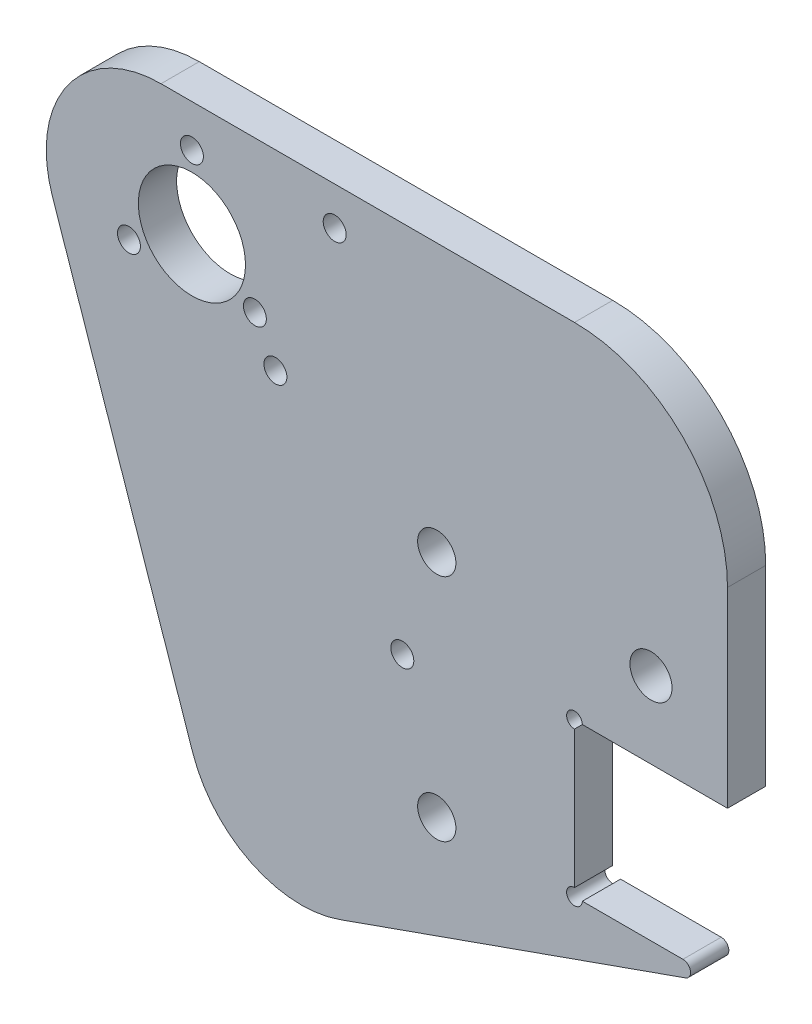
ISO-10303-21;
HEADER;
FILE_DESCRIPTION(('STEP AP214'),'2;1');
FILE_NAME('part.step','',(''),(''),'','','');
FILE_SCHEMA(('AUTOMOTIVE_DESIGN { 1 0 10303 214 1 1 1 1 }'));
ENDSEC;
DATA;
#1=APPLICATION_CONTEXT('core data for automotive mechanical design processes');
#2=APPLICATION_PROTOCOL_DEFINITION('international standard','automotive_design',2000,#1);
#3=PRODUCT_CONTEXT('',#1,'mechanical');
#4=PRODUCT('Part','Part','',(#3));
#5=PRODUCT_RELATED_PRODUCT_CATEGORY('part','',(#4));
#6=PRODUCT_DEFINITION_FORMATION('','',#4);
#7=PRODUCT_DEFINITION_CONTEXT('part definition',#1,'design');
#8=PRODUCT_DEFINITION('design','',#6,#7);
#9=PRODUCT_DEFINITION_SHAPE('','',#8);
#10=(LENGTH_UNIT() NAMED_UNIT(*) SI_UNIT(.MILLI.,.METRE.));
#11=(NAMED_UNIT(*) PLANE_ANGLE_UNIT() SI_UNIT($,.RADIAN.));
#12=(NAMED_UNIT(*) SI_UNIT($,.STERADIAN.) SOLID_ANGLE_UNIT());
#13=UNCERTAINTY_MEASURE_WITH_UNIT(LENGTH_MEASURE(1.E-05),#10,'distance_accuracy_value','');
#14=(GEOMETRIC_REPRESENTATION_CONTEXT(3) GLOBAL_UNCERTAINTY_ASSIGNED_CONTEXT((#13)) GLOBAL_UNIT_ASSIGNED_CONTEXT((#10,
#11,#12)) REPRESENTATION_CONTEXT('',''));
#15=CARTESIAN_POINT('',(0.,0.,0.));
#16=DIRECTION('',(0.,0.,1.));
#17=DIRECTION('',(1.,0.,0.));
#18=AXIS2_PLACEMENT_3D('',#15,#16,#17);
#19=CARTESIAN_POINT('',(50.,-5.,5.));
#20=DIRECTION('',(0.,0.,1.));
#21=DIRECTION('',(1.,0.,0.));
#22=AXIS2_PLACEMENT_3D('',#19,#20,#21);
#23=PLANE('',#22);
#24=CARTESIAN_POINT('',(50.,-50.,5.));
#25=DIRECTION('',(0.,0.,1.));
#26=DIRECTION('',(1.,0.,0.));
#27=AXIS2_PLACEMENT_3D('',#24,#25,#26);
#28=CIRCLE('',#27,1.025);
#29=CARTESIAN_POINT('',(50.,-48.975,5.));
#30=VERTEX_POINT('',#29);
#31=CARTESIAN_POINT('',(51.025,-50.,5.));
#32=VERTEX_POINT('',#31);
#33=EDGE_CURVE('E57',#30,#32,#28,.T.);
#34=ORIENTED_EDGE('',*,*,#33,.F.);
#35=DIRECTION('',(0.,1.,0.));
#36=VECTOR('',#35,1.);
#37=CARTESIAN_POINT('',(50.,-50.,5.));
#38=LINE('',#37,#36);
#39=CARTESIAN_POINT('',(50.,-31.025,5.));
#40=VERTEX_POINT('',#39);
#41=EDGE_CURVE('E148',#30,#40,#38,.T.);
#42=ORIENTED_EDGE('',*,*,#41,.T.);
#43=CARTESIAN_POINT('',(50.,-30.,5.));
#44=DIRECTION('',(0.,0.,1.));
#45=DIRECTION('',(1.,0.,0.));
#46=AXIS2_PLACEMENT_3D('',#43,#44,#45);
#47=CIRCLE('',#46,1.025);
#48=CARTESIAN_POINT('',(51.025,-30.,5.));
#49=VERTEX_POINT('',#48);
#50=EDGE_CURVE('E213',#49,#40,#47,.T.);
#51=ORIENTED_EDGE('',*,*,#50,.F.);
#52=DIRECTION('',(1.,0.,0.));
#53=VECTOR('',#52,1.);
#54=CARTESIAN_POINT('',(50.,-30.,5.));
#55=LINE('',#54,#53);
#56=CARTESIAN_POINT('',(70.,-30.,5.));
#57=VERTEX_POINT('',#56);
#58=EDGE_CURVE('E152',#49,#57,#55,.T.);
#59=ORIENTED_EDGE('',*,*,#58,.T.);
#60=DIRECTION('',(0.,1.,0.));
#61=VECTOR('',#60,1.);
#62=CARTESIAN_POINT('',(70.,-30.,5.));
#63=LINE('',#62,#61);
#64=CARTESIAN_POINT('',(70.,-5.,5.));
#65=VERTEX_POINT('',#64);
#66=EDGE_CURVE('E257',#57,#65,#63,.T.);
#67=ORIENTED_EDGE('',*,*,#66,.T.);
#68=CARTESIAN_POINT('',(50.,-5.,5.));
#69=DIRECTION('',(0.,0.,1.));
#70=DIRECTION('',(1.,0.,0.));
#71=AXIS2_PLACEMENT_3D('',#68,#69,#70);
#72=CIRCLE('',#71,20.);
#73=CARTESIAN_POINT('',(50.,15.,5.));
#74=VERTEX_POINT('',#73);
#75=EDGE_CURVE('E259',#65,#74,#72,.T.);
#76=ORIENTED_EDGE('',*,*,#75,.T.);
#77=DIRECTION('',(-1.,0.,0.));
#78=VECTOR('',#77,1.);
#79=CARTESIAN_POINT('',(50.,15.,5.));
#80=LINE('',#79,#78);
#81=CARTESIAN_POINT('',(-4.03867368295073,15.,5.));
#82=VERTEX_POINT('',#81);
#83=EDGE_CURVE('E261',#74,#82,#80,.T.);
#84=ORIENTED_EDGE('',*,*,#83,.T.);
#85=CARTESIAN_POINT('',(-4.03867368295073,0.,5.));
#86=DIRECTION('',(0.,0.,1.));
#87=DIRECTION('',(1.,0.,0.));
#88=AXIS2_PLACEMENT_3D('',#85,#86,#87);
#89=CIRCLE('',#88,15.);
#90=CARTESIAN_POINT('',(-18.2363265056288,-4.84010891682209,5.));
#91=VERTEX_POINT('',#90);
#92=EDGE_CURVE('E263',#82,#91,#89,.T.);
#93=ORIENTED_EDGE('',*,*,#92,.T.);
#94=DIRECTION('',(0.322673927788139,-0.94651018817854,0.));
#95=VECTOR('',#94,1.);
#96=CARTESIAN_POINT('',(-18.2363265056288,-4.84010891682209,5.));
#97=LINE('',#96,#95);
#98=CARTESIAN_POINT('',(0.103692109745153,-58.6374968552524,5.));
#99=VERTEX_POINT('',#98);
#100=EDGE_CURVE('E265',#91,#99,#97,.T.);
#101=ORIENTED_EDGE('',*,*,#100,.T.);
#102=CARTESIAN_POINT('',(14.3013449324233,-53.7973879384304,5.));
#103=DIRECTION('',(0.,0.,1.));
#104=DIRECTION('',(1.,0.,0.));
#105=AXIS2_PLACEMENT_3D('',#102,#103,#104);
#106=CIRCLE('',#105,15.);
#107=CARTESIAN_POINT('',(19.3050246890061,-67.9382220331209,5.));
#108=VERTEX_POINT('',#107);
#109=EDGE_CURVE('E267',#99,#108,#106,.T.);
#110=ORIENTED_EDGE('',*,*,#109,.T.);
#111=DIRECTION('',(0.942722272979372,0.333578650438854,0.));
#112=VECTOR('',#111,1.);
#113=CARTESIAN_POINT('',(19.3050246890061,-67.9382220331209,5.));
#114=LINE('',#113,#112);
#115=CARTESIAN_POINT('',(64.5096979241888,-51.9427222729794,5.));
#116=VERTEX_POINT('',#115);
#117=EDGE_CURVE('E269',#108,#116,#114,.T.);
#118=ORIENTED_EDGE('',*,*,#117,.T.);
#119=CARTESIAN_POINT('',(64.1761192737499,-51.,5.));
#120=DIRECTION('',(0.,0.,1.));
#121=DIRECTION('',(1.,0.,0.));
#122=AXIS2_PLACEMENT_3D('',#119,#120,#121);
#123=CIRCLE('',#122,1.);
#124=CARTESIAN_POINT('',(64.1761192737499,-50.,5.));
#125=VERTEX_POINT('',#124);
#126=EDGE_CURVE('E134',#116,#125,#123,.T.);
#127=ORIENTED_EDGE('',*,*,#126,.T.);
#128=DIRECTION('',(-1.,0.,0.));
#129=VECTOR('',#128,1.);
#130=CARTESIAN_POINT('',(50.,-50.,5.));
#131=LINE('',#130,#129);
#132=EDGE_CURVE('E163',#125,#32,#131,.T.);
#133=ORIENTED_EDGE('',*,*,#132,.T.);
#134=EDGE_LOOP('',(#34,#42,#51,#59,#67,#76,#84,#93,#101,#110,#118,#127,#133));
#135=FACE_BOUND('',#134,.T.);
#136=CARTESIAN_POINT('',(10.914424011663,-10.,5.));
#137=DIRECTION('',(0.,0.,1.));
#138=DIRECTION('',(1.,0.,0.));
#139=AXIS2_PLACEMENT_3D('',#136,#137,#138);
#140=CIRCLE('',#139,1.50000000000242);
#141=CARTESIAN_POINT('',(12.4144240116654,-10.,5.));
#142=VERTEX_POINT('',#141);
#143=EDGE_CURVE('E201',#142,#142,#140,.T.);
#144=ORIENTED_EDGE('',*,*,#143,.F.);
#145=EDGE_LOOP('',(#144));
#146=FACE_BOUND('',#145,.T.);
#147=CARTESIAN_POINT('',(27.5,-33.82,5.));
#148=DIRECTION('',(0.,0.,1.));
#149=DIRECTION('',(1.,0.,0.));
#150=AXIS2_PLACEMENT_3D('',#147,#148,#149);
#151=CIRCLE('',#150,1.5);
#152=CARTESIAN_POINT('',(29.,-33.82,5.));
#153=VERTEX_POINT('',#152);
#154=EDGE_CURVE('E191',#153,#153,#151,.T.);
#155=ORIENTED_EDGE('',*,*,#154,.F.);
#156=EDGE_LOOP('',(#155));
#157=FACE_BOUND('',#156,.T.);
#158=CARTESIAN_POINT('',(18.66,10.,5.));
#159=DIRECTION('',(0.,0.,1.));
#160=DIRECTION('',(1.,0.,0.));
#161=AXIS2_PLACEMENT_3D('',#158,#159,#160);
#162=CIRCLE('',#161,1.5);
#163=CARTESIAN_POINT('',(20.16,10.,5.));
#164=VERTEX_POINT('',#163);
#165=EDGE_CURVE('E205',#164,#164,#162,.T.);
#166=ORIENTED_EDGE('',*,*,#165,.F.);
#167=EDGE_LOOP('',(#166));
#168=FACE_BOUND('',#167,.T.);
#169=CARTESIAN_POINT('',(60.0000000000001,-20.0000000000002,5.));
#170=DIRECTION('',(0.,0.,1.));
#171=DIRECTION('',(1.,0.,0.));
#172=AXIS2_PLACEMENT_3D('',#169,#170,#171);
#173=CIRCLE('',#172,2.75000000000005);
#174=CARTESIAN_POINT('',(62.7500000000001,-20.0000000000002,5.));
#175=VERTEX_POINT('',#174);
#176=EDGE_CURVE('E200',#175,#175,#173,.T.);
#177=ORIENTED_EDGE('',*,*,#176,.F.);
#178=EDGE_LOOP('',(#177));
#179=FACE_BOUND('',#178,.T.);
#180=CARTESIAN_POINT('',(32.,-50.,5.));
#181=DIRECTION('',(0.,0.,1.));
#182=DIRECTION('',(1.,0.,0.));
#183=AXIS2_PLACEMENT_3D('',#180,#181,#182);
#184=CIRCLE('',#183,2.5);
#185=CARTESIAN_POINT('',(34.5,-50.,5.));
#186=VERTEX_POINT('',#185);
#187=EDGE_CURVE('E227',#186,#186,#184,.T.);
#188=ORIENTED_EDGE('',*,*,#187,.F.);
#189=EDGE_LOOP('',(#188));
#190=FACE_BOUND('',#189,.T.);
#191=CARTESIAN_POINT('',(8.22724133595217,-4.75,5.));
#192=DIRECTION('',(0.,0.,1.));
#193=DIRECTION('',(1.,0.,0.));
#194=AXIS2_PLACEMENT_3D('',#191,#192,#193);
#195=CIRCLE('',#194,1.5);
#196=CARTESIAN_POINT('',(9.72724133595217,-4.75,5.));
#197=VERTEX_POINT('',#196);
#198=EDGE_CURVE('E239',#197,#197,#195,.T.);
#199=ORIENTED_EDGE('',*,*,#198,.F.);
#200=EDGE_LOOP('',(#199));
#201=FACE_BOUND('',#200,.T.);
#202=CARTESIAN_POINT('',(0.,0.,5.));
#203=DIRECTION('',(0.,0.,1.));
#204=DIRECTION('',(1.,0.,0.));
#205=AXIS2_PLACEMENT_3D('',#202,#203,#204);
#206=CIRCLE('',#205,7.);
#207=CARTESIAN_POINT('',(7.,0.,5.));
#208=VERTEX_POINT('',#207);
#209=EDGE_CURVE('E251',#208,#208,#206,.T.);
#210=ORIENTED_EDGE('',*,*,#209,.F.);
#211=EDGE_LOOP('',(#210));
#212=FACE_BOUND('',#211,.T.);
#213=CARTESIAN_POINT('',(0.,9.5,5.));
#214=DIRECTION('',(0.,0.,1.));
#215=DIRECTION('',(1.,0.,0.));
#216=AXIS2_PLACEMENT_3D('',#213,#214,#215);
#217=CIRCLE('',#216,1.5);
#218=CARTESIAN_POINT('',(1.5,9.5,5.));
#219=VERTEX_POINT('',#218);
#220=EDGE_CURVE('E245',#219,#219,#217,.T.);
#221=ORIENTED_EDGE('',*,*,#220,.F.);
#222=EDGE_LOOP('',(#221));
#223=FACE_BOUND('',#222,.T.);
#224=CARTESIAN_POINT('',(-8.22724133595217,-4.75,5.));
#225=DIRECTION('',(0.,0.,1.));
#226=DIRECTION('',(1.,0.,0.));
#227=AXIS2_PLACEMENT_3D('',#224,#225,#226);
#228=CIRCLE('',#227,1.5);
#229=CARTESIAN_POINT('',(-6.72724133595217,-4.75,5.));
#230=VERTEX_POINT('',#229);
#231=EDGE_CURVE('E233',#230,#230,#228,.T.);
#232=ORIENTED_EDGE('',*,*,#231,.F.);
#233=EDGE_LOOP('',(#232));
#234=FACE_BOUND('',#233,.T.);
#235=CARTESIAN_POINT('',(32.,-20.,5.));
#236=DIRECTION('',(0.,0.,1.));
#237=DIRECTION('',(1.,0.,0.));
#238=AXIS2_PLACEMENT_3D('',#235,#236,#237);
#239=CIRCLE('',#238,2.5);
#240=CARTESIAN_POINT('',(34.5,-20.,5.));
#241=VERTEX_POINT('',#240);
#242=EDGE_CURVE('E221',#241,#241,#239,.T.);
#243=ORIENTED_EDGE('',*,*,#242,.F.);
#244=EDGE_LOOP('',(#243));
#245=FACE_BOUND('',#244,.T.);
#246=ADVANCED_FACE('F35',(#135,#146,#157,#168,#179,#190,#201,#212,#223,#234,#245),#23,.T.);
#247=CARTESIAN_POINT('',(50.,-5.,0.));
#248=DIRECTION('',(0.,0.,1.));
#249=DIRECTION('',(1.,0.,0.));
#250=AXIS2_PLACEMENT_3D('',#247,#248,#249);
#251=PLANE('',#250);
#252=CARTESIAN_POINT('',(10.914424011663,-10.,0.));
#253=DIRECTION('',(0.,0.,1.));
#254=DIRECTION('',(1.,0.,0.));
#255=AXIS2_PLACEMENT_3D('',#252,#253,#254);
#256=CIRCLE('',#255,1.50000000000242);
#257=CARTESIAN_POINT('',(12.4144240116654,-10.,0.));
#258=VERTEX_POINT('',#257);
#259=EDGE_CURVE('E198',#258,#258,#256,.T.);
#260=ORIENTED_EDGE('',*,*,#259,.T.);
#261=EDGE_LOOP('',(#260));
#262=FACE_BOUND('',#261,.T.);
#263=CARTESIAN_POINT('',(27.5,-33.82,0.));
#264=DIRECTION('',(0.,0.,1.));
#265=DIRECTION('',(1.,0.,0.));
#266=AXIS2_PLACEMENT_3D('',#263,#264,#265);
#267=CIRCLE('',#266,1.5);
#268=CARTESIAN_POINT('',(29.,-33.82,0.));
#269=VERTEX_POINT('',#268);
#270=EDGE_CURVE('E194',#269,#269,#267,.T.);
#271=ORIENTED_EDGE('',*,*,#270,.T.);
#272=EDGE_LOOP('',(#271));
#273=FACE_BOUND('',#272,.T.);
#274=CARTESIAN_POINT('',(18.66,10.,0.));
#275=DIRECTION('',(0.,0.,1.));
#276=DIRECTION('',(1.,0.,0.));
#277=AXIS2_PLACEMENT_3D('',#274,#275,#276);
#278=CIRCLE('',#277,1.5);
#279=CARTESIAN_POINT('',(20.16,10.,0.));
#280=VERTEX_POINT('',#279);
#281=EDGE_CURVE('E190',#280,#280,#278,.T.);
#282=ORIENTED_EDGE('',*,*,#281,.T.);
#283=EDGE_LOOP('',(#282));
#284=FACE_BOUND('',#283,.T.);
#285=CARTESIAN_POINT('',(60.0000000000001,-20.0000000000002,0.));
#286=DIRECTION('',(0.,0.,1.));
#287=DIRECTION('',(1.,0.,0.));
#288=AXIS2_PLACEMENT_3D('',#285,#286,#287);
#289=CIRCLE('',#288,2.75000000000005);
#290=CARTESIAN_POINT('',(62.7500000000001,-20.0000000000002,0.));
#291=VERTEX_POINT('',#290);
#292=EDGE_CURVE('E187',#291,#291,#289,.T.);
#293=ORIENTED_EDGE('',*,*,#292,.T.);
#294=EDGE_LOOP('',(#293));
#295=FACE_BOUND('',#294,.T.);
#296=DIRECTION('',(0.,1.,0.));
#297=VECTOR('',#296,1.);
#298=CARTESIAN_POINT('',(50.,-50.,0.));
#299=LINE('',#298,#297);
#300=CARTESIAN_POINT('',(50.,-48.975,0.));
#301=VERTEX_POINT('',#300);
#302=CARTESIAN_POINT('',(50.,-31.025,0.));
#303=VERTEX_POINT('',#302);
#304=EDGE_CURVE('E142',#301,#303,#299,.T.);
#305=ORIENTED_EDGE('',*,*,#304,.F.);
#306=CARTESIAN_POINT('',(50.,-50.,0.));
#307=DIRECTION('',(0.,0.,1.));
#308=DIRECTION('',(1.,0.,0.));
#309=AXIS2_PLACEMENT_3D('',#306,#307,#308);
#310=CIRCLE('',#309,1.025);
#311=CARTESIAN_POINT('',(51.025,-50.,0.));
#312=VERTEX_POINT('',#311);
#313=EDGE_CURVE('E128',#301,#312,#310,.T.);
#314=ORIENTED_EDGE('',*,*,#313,.T.);
#315=DIRECTION('',(-1.,0.,0.));
#316=VECTOR('',#315,1.);
#317=CARTESIAN_POINT('',(50.,-50.,0.));
#318=LINE('',#317,#316);
#319=CARTESIAN_POINT('',(64.1761192737499,-50.,0.));
#320=VERTEX_POINT('',#319);
#321=EDGE_CURVE('E140',#320,#312,#318,.T.);
#322=ORIENTED_EDGE('',*,*,#321,.F.);
#323=CARTESIAN_POINT('',(64.1761192737499,-51.,0.));
#324=DIRECTION('',(0.,0.,1.));
#325=DIRECTION('',(1.,0.,0.));
#326=AXIS2_PLACEMENT_3D('',#323,#324,#325);
#327=CIRCLE('',#326,1.);
#328=CARTESIAN_POINT('',(64.5096979241888,-51.9427222729794,0.));
#329=VERTEX_POINT('',#328);
#330=EDGE_CURVE('E182',#320,#329,#327,.F.);
#331=ORIENTED_EDGE('',*,*,#330,.T.);
#332=DIRECTION('',(0.942722272979372,0.333578650438854,0.));
#333=VECTOR('',#332,1.);
#334=CARTESIAN_POINT('',(19.3050246890061,-67.9382220331209,0.));
#335=LINE('',#334,#333);
#336=CARTESIAN_POINT('',(19.3050246890061,-67.9382220331209,0.));
#337=VERTEX_POINT('',#336);
#338=EDGE_CURVE('E149',#337,#329,#335,.T.);
#339=ORIENTED_EDGE('',*,*,#338,.F.);
#340=CARTESIAN_POINT('',(14.3013449324233,-53.7973879384304,0.));
#341=DIRECTION('',(0.,0.,1.));
#342=DIRECTION('',(1.,0.,0.));
#343=AXIS2_PLACEMENT_3D('',#340,#341,#342);
#344=CIRCLE('',#343,15.);
#345=CARTESIAN_POINT('',(0.103692109745153,-58.6374968552524,0.));
#346=VERTEX_POINT('',#345);
#347=EDGE_CURVE('E155',#346,#337,#344,.T.);
#348=ORIENTED_EDGE('',*,*,#347,.F.);
#349=DIRECTION('',(0.322673927788139,-0.94651018817854,0.));
#350=VECTOR('',#349,1.);
#351=CARTESIAN_POINT('',(-18.2363265056288,-4.84010891682209,0.));
#352=LINE('',#351,#350);
#353=CARTESIAN_POINT('',(-18.2363265056288,-4.84010891682209,0.));
#354=VERTEX_POINT('',#353);
#355=EDGE_CURVE('E284',#354,#346,#352,.T.);
#356=ORIENTED_EDGE('',*,*,#355,.F.);
#357=CARTESIAN_POINT('',(-4.03867368295073,0.,0.));
#358=DIRECTION('',(0.,0.,1.));
#359=DIRECTION('',(1.,0.,0.));
#360=AXIS2_PLACEMENT_3D('',#357,#358,#359);
#361=CIRCLE('',#360,15.);
#362=CARTESIAN_POINT('',(-4.03867368295073,15.,0.));
#363=VERTEX_POINT('',#362);
#364=EDGE_CURVE('E282',#363,#354,#361,.T.);
#365=ORIENTED_EDGE('',*,*,#364,.F.);
#366=DIRECTION('',(-1.,0.,0.));
#367=VECTOR('',#366,1.);
#368=CARTESIAN_POINT('',(50.,15.,0.));
#369=LINE('',#368,#367);
#370=CARTESIAN_POINT('',(50.,15.,0.));
#371=VERTEX_POINT('',#370);
#372=EDGE_CURVE('E280',#371,#363,#369,.T.);
#373=ORIENTED_EDGE('',*,*,#372,.F.);
#374=CARTESIAN_POINT('',(50.,-5.,0.));
#375=DIRECTION('',(0.,0.,1.));
#376=DIRECTION('',(1.,0.,0.));
#377=AXIS2_PLACEMENT_3D('',#374,#375,#376);
#378=CIRCLE('',#377,20.);
#379=CARTESIAN_POINT('',(70.,-5.,0.));
#380=VERTEX_POINT('',#379);
#381=EDGE_CURVE('E278',#380,#371,#378,.T.);
#382=ORIENTED_EDGE('',*,*,#381,.F.);
#383=DIRECTION('',(0.,1.,0.));
#384=VECTOR('',#383,1.);
#385=CARTESIAN_POINT('',(70.,-30.,0.));
#386=LINE('',#385,#384);
#387=CARTESIAN_POINT('',(70.,-30.,0.));
#388=VERTEX_POINT('',#387);
#389=EDGE_CURVE('E276',#388,#380,#386,.T.);
#390=ORIENTED_EDGE('',*,*,#389,.F.);
#391=DIRECTION('',(1.,0.,0.));
#392=VECTOR('',#391,1.);
#393=CARTESIAN_POINT('',(50.,-30.,0.));
#394=LINE('',#393,#392);
#395=CARTESIAN_POINT('',(51.025,-30.,0.));
#396=VERTEX_POINT('',#395);
#397=EDGE_CURVE('E274',#396,#388,#394,.T.);
#398=ORIENTED_EDGE('',*,*,#397,.F.);
#399=CARTESIAN_POINT('',(50.,-30.,0.));
#400=DIRECTION('',(0.,0.,1.));
#401=DIRECTION('',(1.,0.,0.));
#402=AXIS2_PLACEMENT_3D('',#399,#400,#401);
#403=CIRCLE('',#402,1.025);
#404=EDGE_CURVE('E50',#396,#303,#403,.T.);
#405=ORIENTED_EDGE('',*,*,#404,.T.);
#406=EDGE_LOOP('',(#305,#314,#322,#331,#339,#348,#356,#365,#373,#382,#390,#398,#405));
#407=FACE_BOUND('',#406,.T.);
#408=CARTESIAN_POINT('',(0.,0.,0.));
#409=DIRECTION('',(0.,0.,1.));
#410=DIRECTION('',(1.,0.,0.));
#411=AXIS2_PLACEMENT_3D('',#408,#409,#410);
#412=CIRCLE('',#411,7.);
#413=CARTESIAN_POINT('',(7.,0.,0.));
#414=VERTEX_POINT('',#413);
#415=EDGE_CURVE('E248',#414,#414,#412,.T.);
#416=ORIENTED_EDGE('',*,*,#415,.T.);
#417=EDGE_LOOP('',(#416));
#418=FACE_BOUND('',#417,.T.);
#419=CARTESIAN_POINT('',(0.,9.5,0.));
#420=DIRECTION('',(0.,0.,1.));
#421=DIRECTION('',(1.,0.,0.));
#422=AXIS2_PLACEMENT_3D('',#419,#420,#421);
#423=CIRCLE('',#422,1.5);
#424=CARTESIAN_POINT('',(1.5,9.5,0.));
#425=VERTEX_POINT('',#424);
#426=EDGE_CURVE('E242',#425,#425,#423,.T.);
#427=ORIENTED_EDGE('',*,*,#426,.T.);
#428=EDGE_LOOP('',(#427));
#429=FACE_BOUND('',#428,.T.);
#430=CARTESIAN_POINT('',(8.22724133595217,-4.75,0.));
#431=DIRECTION('',(0.,0.,1.));
#432=DIRECTION('',(1.,0.,0.));
#433=AXIS2_PLACEMENT_3D('',#430,#431,#432);
#434=CIRCLE('',#433,1.5);
#435=CARTESIAN_POINT('',(9.72724133595217,-4.75,0.));
#436=VERTEX_POINT('',#435);
#437=EDGE_CURVE('E236',#436,#436,#434,.T.);
#438=ORIENTED_EDGE('',*,*,#437,.T.);
#439=EDGE_LOOP('',(#438));
#440=FACE_BOUND('',#439,.T.);
#441=CARTESIAN_POINT('',(-8.22724133595217,-4.75,0.));
#442=DIRECTION('',(0.,0.,1.));
#443=DIRECTION('',(1.,0.,0.));
#444=AXIS2_PLACEMENT_3D('',#441,#442,#443);
#445=CIRCLE('',#444,1.5);
#446=CARTESIAN_POINT('',(-6.72724133595217,-4.75,0.));
#447=VERTEX_POINT('',#446);
#448=EDGE_CURVE('E230',#447,#447,#445,.T.);
#449=ORIENTED_EDGE('',*,*,#448,.T.);
#450=EDGE_LOOP('',(#449));
#451=FACE_BOUND('',#450,.T.);
#452=CARTESIAN_POINT('',(32.,-50.,0.));
#453=DIRECTION('',(0.,0.,1.));
#454=DIRECTION('',(1.,0.,0.));
#455=AXIS2_PLACEMENT_3D('',#452,#453,#454);
#456=CIRCLE('',#455,2.5);
#457=CARTESIAN_POINT('',(34.5,-50.,0.));
#458=VERTEX_POINT('',#457);
#459=EDGE_CURVE('E224',#458,#458,#456,.T.);
#460=ORIENTED_EDGE('',*,*,#459,.T.);
#461=EDGE_LOOP('',(#460));
#462=FACE_BOUND('',#461,.T.);
#463=CARTESIAN_POINT('',(32.,-20.,0.));
#464=DIRECTION('',(0.,0.,1.));
#465=DIRECTION('',(1.,0.,0.));
#466=AXIS2_PLACEMENT_3D('',#463,#464,#465);
#467=CIRCLE('',#466,2.5);
#468=CARTESIAN_POINT('',(34.5,-20.,0.));
#469=VERTEX_POINT('',#468);
#470=EDGE_CURVE('E197',#469,#469,#467,.T.);
#471=ORIENTED_EDGE('',*,*,#470,.T.);
#472=EDGE_LOOP('',(#471));
#473=FACE_BOUND('',#472,.T.);
#474=ADVANCED_FACE('F138',(#262,#273,#284,#295,#407,#418,#429,#440,#451,#462,#473),#251,.F.);
#475=CARTESIAN_POINT('',(50.,-50.,5.));
#476=DIRECTION('',(-1.,0.,0.));
#477=DIRECTION('',(0.,0.,1.));
#478=AXIS2_PLACEMENT_3D('',#475,#476,#477);
#479=PLANE('',#478);
#480=ORIENTED_EDGE('',*,*,#41,.F.);
#481=DIRECTION('',(0.,0.,-1.));
#482=VECTOR('',#481,1.);
#483=CARTESIAN_POINT('',(50.,-48.975,30.));
#484=LINE('',#483,#482);
#485=EDGE_CURVE('E332',#30,#301,#484,.T.);
#486=ORIENTED_EDGE('',*,*,#485,.T.);
#487=ORIENTED_EDGE('',*,*,#304,.T.);
#488=DIRECTION('',(0.,0.,-1.));
#489=VECTOR('',#488,1.);
#490=CARTESIAN_POINT('',(50.,-31.025,30.));
#491=LINE('',#490,#489);
#492=EDGE_CURVE('E208',#303,#40,#491,.F.);
#493=ORIENTED_EDGE('',*,*,#492,.T.);
#494=EDGE_LOOP('',(#480,#486,#487,#493));
#495=FACE_BOUND('',#494,.T.);
#496=ADVANCED_FACE('F337',(#495),#479,.F.);
#497=CARTESIAN_POINT('',(50.,-30.,5.));
#498=DIRECTION('',(0.,1.,0.));
#499=DIRECTION('',(0.,0.,1.));
#500=AXIS2_PLACEMENT_3D('',#497,#498,#499);
#501=PLANE('',#500);
#502=ORIENTED_EDGE('',*,*,#58,.F.);
#503=DIRECTION('',(0.,0.,-1.));
#504=VECTOR('',#503,1.);
#505=CARTESIAN_POINT('',(51.025,-30.,30.));
#506=LINE('',#505,#504);
#507=EDGE_CURVE('E11',#49,#396,#506,.T.);
#508=ORIENTED_EDGE('',*,*,#507,.T.);
#509=ORIENTED_EDGE('',*,*,#397,.T.);
#510=DIRECTION('',(0.,0.,-1.));
#511=VECTOR('',#510,1.);
#512=CARTESIAN_POINT('',(70.,-30.,5.));
#513=LINE('',#512,#511);
#514=EDGE_CURVE('E178',#57,#388,#513,.T.);
#515=ORIENTED_EDGE('',*,*,#514,.F.);
#516=EDGE_LOOP('',(#502,#508,#509,#515));
#517=FACE_BOUND('',#516,.T.);
#518=ADVANCED_FACE('F328',(#517),#501,.F.);
#519=CARTESIAN_POINT('',(70.,-30.,5.));
#520=DIRECTION('',(-1.,0.,0.));
#521=DIRECTION('',(0.,0.,1.));
#522=AXIS2_PLACEMENT_3D('',#519,#520,#521);
#523=PLANE('',#522);
#524=ORIENTED_EDGE('',*,*,#389,.T.);
#525=DIRECTION('',(0.,0.,-1.));
#526=VECTOR('',#525,1.);
#527=CARTESIAN_POINT('',(70.,-5.,5.));
#528=LINE('',#527,#526);
#529=EDGE_CURVE('E175',#65,#380,#528,.T.);
#530=ORIENTED_EDGE('',*,*,#529,.F.);
#531=ORIENTED_EDGE('',*,*,#66,.F.);
#532=ORIENTED_EDGE('',*,*,#514,.T.);
#533=EDGE_LOOP('',(#524,#530,#531,#532));
#534=FACE_BOUND('',#533,.T.);
#535=ADVANCED_FACE('F323',(#534),#523,.F.);
#536=CARTESIAN_POINT('',(50.,-5.,5.));
#537=DIRECTION('',(0.,0.,-1.));
#538=DIRECTION('',(-1.,0.,0.));
#539=AXIS2_PLACEMENT_3D('',#536,#537,#538);
#540=CYLINDRICAL_SURFACE('',#539,20.);
#541=ORIENTED_EDGE('',*,*,#381,.T.);
#542=DIRECTION('',(0.,0.,-1.));
#543=VECTOR('',#542,1.);
#544=CARTESIAN_POINT('',(50.,15.,5.));
#545=LINE('',#544,#543);
#546=EDGE_CURVE('E172',#74,#371,#545,.T.);
#547=ORIENTED_EDGE('',*,*,#546,.F.);
#548=ORIENTED_EDGE('',*,*,#75,.F.);
#549=ORIENTED_EDGE('',*,*,#529,.T.);
#550=EDGE_LOOP('',(#541,#547,#548,#549));
#551=FACE_BOUND('',#550,.T.);
#552=ADVANCED_FACE('F318',(#551),#540,.T.);
#553=CARTESIAN_POINT('',(50.,15.,5.));
#554=DIRECTION('',(0.,-1.,0.));
#555=DIRECTION('',(1.,0.,0.));
#556=AXIS2_PLACEMENT_3D('',#553,#554,#555);
#557=PLANE('',#556);
#558=ORIENTED_EDGE('',*,*,#372,.T.);
#559=DIRECTION('',(0.,0.,-1.));
#560=VECTOR('',#559,1.);
#561=CARTESIAN_POINT('',(-4.03867368295073,15.,5.));
#562=LINE('',#561,#560);
#563=EDGE_CURVE('E169',#82,#363,#562,.T.);
#564=ORIENTED_EDGE('',*,*,#563,.F.);
#565=ORIENTED_EDGE('',*,*,#83,.F.);
#566=ORIENTED_EDGE('',*,*,#546,.T.);
#567=EDGE_LOOP('',(#558,#564,#565,#566));
#568=FACE_BOUND('',#567,.T.);
#569=ADVANCED_FACE('F314',(#568),#557,.F.);
#570=CARTESIAN_POINT('',(-4.03867368295073,0.,5.));
#571=DIRECTION('',(0.,0.,-1.));
#572=DIRECTION('',(-1.,0.,0.));
#573=AXIS2_PLACEMENT_3D('',#570,#571,#572);
#574=CYLINDRICAL_SURFACE('',#573,15.);
#575=ORIENTED_EDGE('',*,*,#364,.T.);
#576=DIRECTION('',(0.,0.,-1.));
#577=VECTOR('',#576,1.);
#578=CARTESIAN_POINT('',(-18.2363265056288,-4.84010891682209,5.));
#579=LINE('',#578,#577);
#580=EDGE_CURVE('E166',#91,#354,#579,.T.);
#581=ORIENTED_EDGE('',*,*,#580,.F.);
#582=ORIENTED_EDGE('',*,*,#92,.F.);
#583=ORIENTED_EDGE('',*,*,#563,.T.);
#584=EDGE_LOOP('',(#575,#581,#582,#583));
#585=FACE_BOUND('',#584,.T.);
#586=ADVANCED_FACE('F310',(#585),#574,.T.);
#587=CARTESIAN_POINT('',(-18.2363265056288,-4.84010891682209,5.));
#588=DIRECTION('',(0.94651018817854,0.322673927788139,0.));
#589=DIRECTION('',(-0.322673927788139,0.94651018817854,0.));
#590=AXIS2_PLACEMENT_3D('',#587,#588,#589);
#591=PLANE('',#590);
#592=ORIENTED_EDGE('',*,*,#355,.T.);
#593=DIRECTION('',(0.,0.,-1.));
#594=VECTOR('',#593,1.);
#595=CARTESIAN_POINT('',(0.103692109745153,-58.6374968552524,5.));
#596=LINE('',#595,#594);
#597=EDGE_CURVE('E162',#99,#346,#596,.T.);
#598=ORIENTED_EDGE('',*,*,#597,.F.);
#599=ORIENTED_EDGE('',*,*,#100,.F.);
#600=ORIENTED_EDGE('',*,*,#580,.T.);
#601=EDGE_LOOP('',(#592,#598,#599,#600));
#602=FACE_BOUND('',#601,.T.);
#603=ADVANCED_FACE('F305',(#602),#591,.F.);
#604=CARTESIAN_POINT('',(14.3013449324233,-53.7973879384304,5.));
#605=DIRECTION('',(0.,0.,-1.));
#606=DIRECTION('',(-1.,0.,0.));
#607=AXIS2_PLACEMENT_3D('',#604,#605,#606);
#608=CYLINDRICAL_SURFACE('',#607,15.);
#609=ORIENTED_EDGE('',*,*,#347,.T.);
#610=DIRECTION('',(0.,0.,-1.));
#611=VECTOR('',#610,1.);
#612=CARTESIAN_POINT('',(19.3050246890061,-67.9382220331209,5.));
#613=LINE('',#612,#611);
#614=EDGE_CURVE('E159',#108,#337,#613,.T.);
#615=ORIENTED_EDGE('',*,*,#614,.F.);
#616=ORIENTED_EDGE('',*,*,#109,.F.);
#617=ORIENTED_EDGE('',*,*,#597,.T.);
#618=EDGE_LOOP('',(#609,#615,#616,#617));
#619=FACE_BOUND('',#618,.T.);
#620=ADVANCED_FACE('F288',(#619),#608,.T.);
#621=CARTESIAN_POINT('',(19.3050246890061,-67.9382220331209,5.));
#622=DIRECTION('',(-0.333578650438854,0.942722272979372,0.));
#623=DIRECTION('',(-0.942722272979372,-0.333578650438854,0.));
#624=AXIS2_PLACEMENT_3D('',#621,#622,#623);
#625=PLANE('',#624);
#626=ORIENTED_EDGE('',*,*,#338,.T.);
#627=DIRECTION('',(0.,0.,-1.));
#628=VECTOR('',#627,1.);
#629=CARTESIAN_POINT('',(64.5096979241888,-51.9427222729794,5.));
#630=LINE('',#629,#628);
#631=EDGE_CURVE('E184',#329,#116,#630,.F.);
#632=ORIENTED_EDGE('',*,*,#631,.T.);
#633=ORIENTED_EDGE('',*,*,#117,.F.);
#634=ORIENTED_EDGE('',*,*,#614,.T.);
#635=EDGE_LOOP('',(#626,#632,#633,#634));
#636=FACE_BOUND('',#635,.T.);
#637=ADVANCED_FACE('F295',(#636),#625,.F.);
#638=CARTESIAN_POINT('',(50.,-50.,5.));
#639=DIRECTION('',(0.,-1.,0.));
#640=DIRECTION('',(0.,0.,-1.));
#641=AXIS2_PLACEMENT_3D('',#638,#639,#640);
#642=PLANE('',#641);
#643=ORIENTED_EDGE('',*,*,#321,.T.);
#644=DIRECTION('',(0.,0.,-1.));
#645=VECTOR('',#644,1.);
#646=CARTESIAN_POINT('',(51.025,-50.,30.));
#647=LINE('',#646,#645);
#648=EDGE_CURVE('E43',#312,#32,#647,.F.);
#649=ORIENTED_EDGE('',*,*,#648,.T.);
#650=ORIENTED_EDGE('',*,*,#132,.F.);
#651=DIRECTION('',(0.,0.,-1.));
#652=VECTOR('',#651,1.);
#653=CARTESIAN_POINT('',(64.1761192737499,-50.,5.));
#654=LINE('',#653,#652);
#655=EDGE_CURVE('E147',#125,#320,#654,.T.);
#656=ORIENTED_EDGE('',*,*,#655,.T.);
#657=EDGE_LOOP('',(#643,#649,#650,#656));
#658=FACE_BOUND('',#657,.T.);
#659=ADVANCED_FACE('F145',(#658),#642,.F.);
#660=CARTESIAN_POINT('',(0.,0.,5.));
#661=DIRECTION('',(0.,0.,-1.));
#662=DIRECTION('',(-1.,0.,0.));
#663=AXIS2_PLACEMENT_3D('',#660,#661,#662);
#664=CYLINDRICAL_SURFACE('',#663,7.);
#665=ORIENTED_EDGE('',*,*,#209,.T.);
#666=EDGE_LOOP('',(#665));
#667=FACE_BOUND('',#666,.T.);
#668=ORIENTED_EDGE('',*,*,#415,.F.);
#669=EDGE_LOOP('',(#668));
#670=FACE_BOUND('',#669,.T.);
#671=ADVANCED_FACE('F351',(#667,#670),#664,.F.);
#672=CARTESIAN_POINT('',(0.,9.5,5.));
#673=DIRECTION('',(0.,0.,-1.));
#674=DIRECTION('',(-1.,0.,0.));
#675=AXIS2_PLACEMENT_3D('',#672,#673,#674);
#676=CYLINDRICAL_SURFACE('',#675,1.5);
#677=ORIENTED_EDGE('',*,*,#220,.T.);
#678=EDGE_LOOP('',(#677));
#679=FACE_BOUND('',#678,.T.);
#680=ORIENTED_EDGE('',*,*,#426,.F.);
#681=EDGE_LOOP('',(#680));
#682=FACE_BOUND('',#681,.T.);
#683=ADVANCED_FACE('F414',(#679,#682),#676,.F.);
#684=CARTESIAN_POINT('',(8.22724133595217,-4.75,5.));
#685=DIRECTION('',(0.,0.,-1.));
#686=DIRECTION('',(-1.,0.,0.));
#687=AXIS2_PLACEMENT_3D('',#684,#685,#686);
#688=CYLINDRICAL_SURFACE('',#687,1.5);
#689=ORIENTED_EDGE('',*,*,#198,.T.);
#690=EDGE_LOOP('',(#689));
#691=FACE_BOUND('',#690,.T.);
#692=ORIENTED_EDGE('',*,*,#437,.F.);
#693=EDGE_LOOP('',(#692));
#694=FACE_BOUND('',#693,.T.);
#695=ADVANCED_FACE('F420',(#691,#694),#688,.F.);
#696=CARTESIAN_POINT('',(-8.22724133595217,-4.75,5.));
#697=DIRECTION('',(0.,0.,-1.));
#698=DIRECTION('',(-1.,0.,0.));
#699=AXIS2_PLACEMENT_3D('',#696,#697,#698);
#700=CYLINDRICAL_SURFACE('',#699,1.5);
#701=ORIENTED_EDGE('',*,*,#231,.T.);
#702=EDGE_LOOP('',(#701));
#703=FACE_BOUND('',#702,.T.);
#704=ORIENTED_EDGE('',*,*,#448,.F.);
#705=EDGE_LOOP('',(#704));
#706=FACE_BOUND('',#705,.T.);
#707=ADVANCED_FACE('F427',(#703,#706),#700,.F.);
#708=CARTESIAN_POINT('',(32.,-50.,5.));
#709=DIRECTION('',(0.,0.,-1.));
#710=DIRECTION('',(-1.,0.,0.));
#711=AXIS2_PLACEMENT_3D('',#708,#709,#710);
#712=CYLINDRICAL_SURFACE('',#711,2.5);
#713=ORIENTED_EDGE('',*,*,#187,.T.);
#714=EDGE_LOOP('',(#713));
#715=FACE_BOUND('',#714,.T.);
#716=ORIENTED_EDGE('',*,*,#459,.F.);
#717=EDGE_LOOP('',(#716));
#718=FACE_BOUND('',#717,.T.);
#719=ADVANCED_FACE('F435',(#715,#718),#712,.F.);
#720=CARTESIAN_POINT('',(32.,-20.,5.));
#721=DIRECTION('',(0.,0.,-1.));
#722=DIRECTION('',(-1.,0.,0.));
#723=AXIS2_PLACEMENT_3D('',#720,#721,#722);
#724=CYLINDRICAL_SURFACE('',#723,2.5);
#725=ORIENTED_EDGE('',*,*,#242,.T.);
#726=EDGE_LOOP('',(#725));
#727=FACE_BOUND('',#726,.T.);
#728=ORIENTED_EDGE('',*,*,#470,.F.);
#729=EDGE_LOOP('',(#728));
#730=FACE_BOUND('',#729,.T.);
#731=ADVANCED_FACE('F443',(#727,#730),#724,.F.);
#732=CARTESIAN_POINT('',(64.1761192737499,-51.,5.));
#733=DIRECTION('',(0.,0.,-1.));
#734=DIRECTION('',(-1.,0.,0.));
#735=AXIS2_PLACEMENT_3D('',#732,#733,#734);
#736=CYLINDRICAL_SURFACE('',#735,1.);
#737=ORIENTED_EDGE('',*,*,#126,.F.);
#738=ORIENTED_EDGE('',*,*,#631,.F.);
#739=ORIENTED_EDGE('',*,*,#330,.F.);
#740=ORIENTED_EDGE('',*,*,#655,.F.);
#741=EDGE_LOOP('',(#737,#738,#739,#740));
#742=FACE_BOUND('',#741,.T.);
#743=ADVANCED_FACE('F37',(#742),#736,.T.);
#744=CARTESIAN_POINT('',(60.0000000000001,-20.0000000000002,-5.));
#745=DIRECTION('',(0.,0.,1.));
#746=DIRECTION('',(1.,0.,0.));
#747=AXIS2_PLACEMENT_3D('',#744,#745,#746);
#748=CYLINDRICAL_SURFACE('',#747,2.75000000000005);
#749=ORIENTED_EDGE('',*,*,#176,.T.);
#750=EDGE_LOOP('',(#749));
#751=FACE_BOUND('',#750,.T.);
#752=ORIENTED_EDGE('',*,*,#292,.F.);
#753=EDGE_LOOP('',(#752));
#754=FACE_BOUND('',#753,.T.);
#755=ADVANCED_FACE('F456',(#751,#754),#748,.F.);
#756=CARTESIAN_POINT('',(18.66,10.,-5.));
#757=DIRECTION('',(0.,0.,1.));
#758=DIRECTION('',(1.,0.,0.));
#759=AXIS2_PLACEMENT_3D('',#756,#757,#758);
#760=CYLINDRICAL_SURFACE('',#759,1.5);
#761=ORIENTED_EDGE('',*,*,#165,.T.);
#762=EDGE_LOOP('',(#761));
#763=FACE_BOUND('',#762,.T.);
#764=ORIENTED_EDGE('',*,*,#281,.F.);
#765=EDGE_LOOP('',(#764));
#766=FACE_BOUND('',#765,.T.);
#767=ADVANCED_FACE('F462',(#763,#766),#760,.F.);
#768=CARTESIAN_POINT('',(27.5,-33.82,-5.));
#769=DIRECTION('',(0.,0.,1.));
#770=DIRECTION('',(1.,0.,0.));
#771=AXIS2_PLACEMENT_3D('',#768,#769,#770);
#772=CYLINDRICAL_SURFACE('',#771,1.5);
#773=ORIENTED_EDGE('',*,*,#154,.T.);
#774=EDGE_LOOP('',(#773));
#775=FACE_BOUND('',#774,.T.);
#776=ORIENTED_EDGE('',*,*,#270,.F.);
#777=EDGE_LOOP('',(#776));
#778=FACE_BOUND('',#777,.T.);
#779=ADVANCED_FACE('F470',(#775,#778),#772,.F.);
#780=CARTESIAN_POINT('',(10.914424011663,-10.,-5.));
#781=DIRECTION('',(0.,0.,1.));
#782=DIRECTION('',(1.,0.,0.));
#783=AXIS2_PLACEMENT_3D('',#780,#781,#782);
#784=CYLINDRICAL_SURFACE('',#783,1.50000000000242);
#785=ORIENTED_EDGE('',*,*,#143,.T.);
#786=EDGE_LOOP('',(#785));
#787=FACE_BOUND('',#786,.T.);
#788=ORIENTED_EDGE('',*,*,#259,.F.);
#789=EDGE_LOOP('',(#788));
#790=FACE_BOUND('',#789,.T.);
#791=ADVANCED_FACE('F478',(#787,#790),#784,.F.);
#792=CARTESIAN_POINT('',(50.,-50.,30.));
#793=DIRECTION('',(0.,0.,-1.));
#794=DIRECTION('',(-1.,0.,0.));
#795=AXIS2_PLACEMENT_3D('',#792,#793,#794);
#796=CYLINDRICAL_SURFACE('',#795,1.025);
#797=ORIENTED_EDGE('',*,*,#33,.T.);
#798=ORIENTED_EDGE('',*,*,#648,.F.);
#799=ORIENTED_EDGE('',*,*,#313,.F.);
#800=ORIENTED_EDGE('',*,*,#485,.F.);
#801=EDGE_LOOP('',(#797,#798,#799,#800));
#802=FACE_BOUND('',#801,.T.);
#803=ADVANCED_FACE('F127',(#802),#796,.F.);
#804=CARTESIAN_POINT('',(50.,-30.,30.));
#805=DIRECTION('',(0.,0.,-1.));
#806=DIRECTION('',(-1.,0.,0.));
#807=AXIS2_PLACEMENT_3D('',#804,#805,#806);
#808=CYLINDRICAL_SURFACE('',#807,1.025);
#809=ORIENTED_EDGE('',*,*,#404,.F.);
#810=ORIENTED_EDGE('',*,*,#507,.F.);
#811=ORIENTED_EDGE('',*,*,#50,.T.);
#812=ORIENTED_EDGE('',*,*,#492,.F.);
#813=EDGE_LOOP('',(#809,#810,#811,#812));
#814=FACE_BOUND('',#813,.T.);
#815=ADVANCED_FACE('F330',(#814),#808,.F.);
#816=CLOSED_SHELL('',(#246,#474,#496,#518,#535,#552,#569,#586,#603,#620,#637,#659,#671,#683,
#695,#707,#719,#731,#743,#755,#767,#779,#791,#803,#815));
#817=MANIFOLD_SOLID_BREP('B2',#816);
#818=ADVANCED_BREP_SHAPE_REPRESENTATION('',(#18,#817),#14);
#819=SHAPE_DEFINITION_REPRESENTATION(#9,#818);
ENDSEC;
END-ISO-10303-21;
